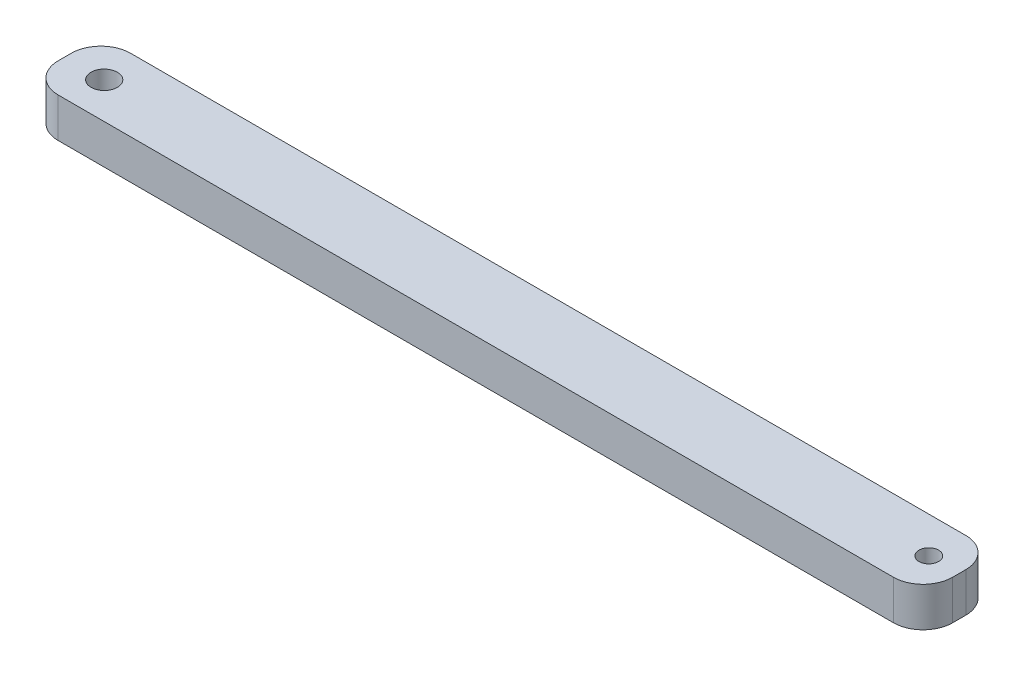
ISO-10303-21;
HEADER;
FILE_DESCRIPTION(('STEP AP214'),'2;1');
FILE_NAME('part.step','',(''),(''),'','','');
FILE_SCHEMA(('AUTOMOTIVE_DESIGN { 1 0 10303 214 1 1 1 1 }'));
ENDSEC;
DATA;
#1=APPLICATION_CONTEXT('core data for automotive mechanical design processes');
#2=APPLICATION_PROTOCOL_DEFINITION('international standard','automotive_design',2000,#1);
#3=PRODUCT_CONTEXT('',#1,'mechanical');
#4=PRODUCT('Part','Part','',(#3));
#5=PRODUCT_RELATED_PRODUCT_CATEGORY('part','',(#4));
#6=PRODUCT_DEFINITION_FORMATION('','',#4);
#7=PRODUCT_DEFINITION_CONTEXT('part definition',#1,'design');
#8=PRODUCT_DEFINITION('design','',#6,#7);
#9=PRODUCT_DEFINITION_SHAPE('','',#8);
#10=(LENGTH_UNIT() NAMED_UNIT(*) SI_UNIT(.MILLI.,.METRE.));
#11=(NAMED_UNIT(*) PLANE_ANGLE_UNIT() SI_UNIT($,.RADIAN.));
#12=(NAMED_UNIT(*) SI_UNIT($,.STERADIAN.) SOLID_ANGLE_UNIT());
#13=UNCERTAINTY_MEASURE_WITH_UNIT(LENGTH_MEASURE(1.E-05),#10,'distance_accuracy_value','');
#14=(GEOMETRIC_REPRESENTATION_CONTEXT(3) GLOBAL_UNCERTAINTY_ASSIGNED_CONTEXT((#13)) GLOBAL_UNIT_ASSIGNED_CONTEXT((#10,
#11,#12)) REPRESENTATION_CONTEXT('',''));
#15=CARTESIAN_POINT('',(0.,0.,0.));
#16=DIRECTION('',(0.,0.,1.));
#17=DIRECTION('',(1.,0.,0.));
#18=AXIS2_PLACEMENT_3D('',#15,#16,#17);
#19=CARTESIAN_POINT('',(0.,3.,0.));
#20=DIRECTION('',(0.,1.,0.));
#21=DIRECTION('',(0.,0.,1.));
#22=AXIS2_PLACEMENT_3D('',#19,#20,#21);
#23=PLANE('',#22);
#24=CARTESIAN_POINT('',(36.0480952380952,3.,-10.9404761904762));
#25=DIRECTION('',(0.,1.,0.));
#26=DIRECTION('',(0.,0.,1.));
#27=AXIS2_PLACEMENT_3D('',#24,#25,#26);
#28=CIRCLE('',#27,0.749999999999999);
#29=CARTESIAN_POINT('',(36.0480952380952,3.,-10.1904761904762));
#30=VERTEX_POINT('',#29);
#31=EDGE_CURVE('E136',#30,#30,#28,.T.);
#32=ORIENTED_EDGE('',*,*,#31,.F.);
#33=EDGE_LOOP('',(#32));
#34=FACE_BOUND('',#33,.T.);
#35=DIRECTION('',(-1.,0.,0.));
#36=VECTOR('',#35,1.);
#37=CARTESIAN_POINT('',(-29.6369047619048,3.,-13.6904761904762));
#38=LINE('',#37,#36);
#39=CARTESIAN_POINT('',(36.1130952380952,3.,-13.6904761904762));
#40=VERTEX_POINT('',#39);
#41=CARTESIAN_POINT('',(-27.3869047619048,3.,-13.6904761904762));
#42=VERTEX_POINT('',#41);
#43=EDGE_CURVE('E147',#40,#42,#38,.T.);
#44=ORIENTED_EDGE('',*,*,#43,.T.);
#45=CARTESIAN_POINT('',(-27.3869047619048,3.,-11.4404761904762));
#46=DIRECTION('',(0.,1.,0.));
#47=DIRECTION('',(0.,0.,1.));
#48=AXIS2_PLACEMENT_3D('',#45,#46,#47);
#49=CIRCLE('',#48,2.25);
#50=CARTESIAN_POINT('',(-29.6369047619048,3.,-11.4404761904762));
#51=VERTEX_POINT('',#50);
#52=EDGE_CURVE('E177',#42,#51,#49,.T.);
#53=ORIENTED_EDGE('',*,*,#52,.T.);
#54=DIRECTION('',(0.,0.,1.));
#55=VECTOR('',#54,1.);
#56=CARTESIAN_POINT('',(-29.6369047619048,3.,-13.6904761904762));
#57=LINE('',#56,#55);
#58=CARTESIAN_POINT('',(-29.6369047619048,3.,-10.4404761904762));
#59=VERTEX_POINT('',#58);
#60=EDGE_CURVE('E126',#51,#59,#57,.T.);
#61=ORIENTED_EDGE('',*,*,#60,.T.);
#62=CARTESIAN_POINT('',(-27.3869047619048,3.,-10.4404761904762));
#63=DIRECTION('',(0.,1.,0.));
#64=DIRECTION('',(0.,0.,1.));
#65=AXIS2_PLACEMENT_3D('',#62,#63,#64);
#66=CIRCLE('',#65,2.25);
#67=CARTESIAN_POINT('',(-27.3869047619048,3.,-8.19047619047619));
#68=VERTEX_POINT('',#67);
#69=EDGE_CURVE('E174',#59,#68,#66,.T.);
#70=ORIENTED_EDGE('',*,*,#69,.T.);
#71=DIRECTION('',(1.,0.,0.));
#72=VECTOR('',#71,1.);
#73=CARTESIAN_POINT('',(-29.6369047619048,3.,-8.19047619047619));
#74=LINE('',#73,#72);
#75=CARTESIAN_POINT('',(36.1130952380952,3.,-8.19047619047619));
#76=VERTEX_POINT('',#75);
#77=EDGE_CURVE('E203',#68,#76,#74,.T.);
#78=ORIENTED_EDGE('',*,*,#77,.T.);
#79=CARTESIAN_POINT('',(36.1130952380952,3.,-10.4404761904762));
#80=DIRECTION('',(0.,1.,0.));
#81=DIRECTION('',(0.,0.,1.));
#82=AXIS2_PLACEMENT_3D('',#79,#80,#81);
#83=CIRCLE('',#82,2.25);
#84=CARTESIAN_POINT('',(38.3630952380952,3.,-10.4404761904762));
#85=VERTEX_POINT('',#84);
#86=EDGE_CURVE('E60',#76,#85,#83,.T.);
#87=ORIENTED_EDGE('',*,*,#86,.T.);
#88=DIRECTION('',(0.,0.,-1.));
#89=VECTOR('',#88,1.);
#90=CARTESIAN_POINT('',(38.3630952380952,3.,-13.6904761904762));
#91=LINE('',#90,#89);
#92=CARTESIAN_POINT('',(38.3630952380952,3.,-11.4404761904762));
#93=VERTEX_POINT('',#92);
#94=EDGE_CURVE('E191',#85,#93,#91,.T.);
#95=ORIENTED_EDGE('',*,*,#94,.T.);
#96=CARTESIAN_POINT('',(36.1130952380952,3.,-11.4404761904762));
#97=DIRECTION('',(0.,1.,0.));
#98=DIRECTION('',(0.,0.,1.));
#99=AXIS2_PLACEMENT_3D('',#96,#97,#98);
#100=CIRCLE('',#99,2.25);
#101=EDGE_CURVE('E171',#93,#40,#100,.T.);
#102=ORIENTED_EDGE('',*,*,#101,.T.);
#103=EDGE_LOOP('',(#44,#53,#61,#70,#78,#87,#95,#102));
#104=FACE_BOUND('',#103,.T.);
#105=CARTESIAN_POINT('',(-26.6369047619048,3.,-10.9404761904762));
#106=DIRECTION('',(0.,1.,0.));
#107=DIRECTION('',(0.,0.,-1.));
#108=AXIS2_PLACEMENT_3D('',#105,#106,#107);
#109=CIRCLE('',#108,1.);
#110=CARTESIAN_POINT('',(-26.6369047619048,3.,-11.9404761904762));
#111=VERTEX_POINT('',#110);
#112=EDGE_CURVE('E211',#111,#111,#109,.T.);
#113=ORIENTED_EDGE('',*,*,#112,.F.);
#114=EDGE_LOOP('',(#113));
#115=FACE_BOUND('',#114,.T.);
#116=ADVANCED_FACE('F39',(#34,#104,#115),#23,.T.);
#117=CARTESIAN_POINT('',(0.,0.,0.));
#118=DIRECTION('',(0.,1.,0.));
#119=DIRECTION('',(0.,0.,1.));
#120=AXIS2_PLACEMENT_3D('',#117,#118,#119);
#121=PLANE('',#120);
#122=DIRECTION('',(0.,0.,1.));
#123=VECTOR('',#122,1.);
#124=CARTESIAN_POINT('',(-29.6369047619048,0.,-13.6904761904762));
#125=LINE('',#124,#123);
#126=CARTESIAN_POINT('',(-29.6369047619048,0.,-11.4404761904762));
#127=VERTEX_POINT('',#126);
#128=CARTESIAN_POINT('',(-29.6369047619048,0.,-10.4404761904762));
#129=VERTEX_POINT('',#128);
#130=EDGE_CURVE('E123',#127,#129,#125,.T.);
#131=ORIENTED_EDGE('',*,*,#130,.F.);
#132=CARTESIAN_POINT('',(-27.3869047619048,0.,-11.4404761904762));
#133=DIRECTION('',(0.,1.,0.));
#134=DIRECTION('',(0.,0.,1.));
#135=AXIS2_PLACEMENT_3D('',#132,#133,#134);
#136=CIRCLE('',#135,2.25);
#137=CARTESIAN_POINT('',(-27.3869047619048,0.,-13.6904761904762));
#138=VERTEX_POINT('',#137);
#139=EDGE_CURVE('E105',#127,#138,#136,.F.);
#140=ORIENTED_EDGE('',*,*,#139,.T.);
#141=DIRECTION('',(-1.,0.,0.));
#142=VECTOR('',#141,1.);
#143=CARTESIAN_POINT('',(-29.6369047619048,0.,-13.6904761904762));
#144=LINE('',#143,#142);
#145=CARTESIAN_POINT('',(36.1130952380952,0.,-13.6904761904762));
#146=VERTEX_POINT('',#145);
#147=EDGE_CURVE('E152',#146,#138,#144,.T.);
#148=ORIENTED_EDGE('',*,*,#147,.F.);
#149=CARTESIAN_POINT('',(36.1130952380952,0.,-11.4404761904762));
#150=DIRECTION('',(0.,1.,0.));
#151=DIRECTION('',(0.,0.,1.));
#152=AXIS2_PLACEMENT_3D('',#149,#150,#151);
#153=CIRCLE('',#152,2.25);
#154=CARTESIAN_POINT('',(38.3630952380952,0.,-11.4404761904762));
#155=VERTEX_POINT('',#154);
#156=EDGE_CURVE('E159',#146,#155,#153,.F.);
#157=ORIENTED_EDGE('',*,*,#156,.T.);
#158=DIRECTION('',(0.,0.,-1.));
#159=VECTOR('',#158,1.);
#160=CARTESIAN_POINT('',(38.3630952380952,0.,-13.6904761904762));
#161=LINE('',#160,#159);
#162=CARTESIAN_POINT('',(38.3630952380952,0.,-10.4404761904762));
#163=VERTEX_POINT('',#162);
#164=EDGE_CURVE('E141',#163,#155,#161,.T.);
#165=ORIENTED_EDGE('',*,*,#164,.F.);
#166=CARTESIAN_POINT('',(36.1130952380952,0.,-10.4404761904762));
#167=DIRECTION('',(0.,1.,0.));
#168=DIRECTION('',(0.,0.,1.));
#169=AXIS2_PLACEMENT_3D('',#166,#167,#168);
#170=CIRCLE('',#169,2.25);
#171=CARTESIAN_POINT('',(36.1130952380952,0.,-8.19047619047619));
#172=VERTEX_POINT('',#171);
#173=EDGE_CURVE('E128',#163,#172,#170,.F.);
#174=ORIENTED_EDGE('',*,*,#173,.T.);
#175=DIRECTION('',(1.,0.,0.));
#176=VECTOR('',#175,1.);
#177=CARTESIAN_POINT('',(-29.6369047619048,0.,-8.19047619047619));
#178=LINE('',#177,#176);
#179=CARTESIAN_POINT('',(-27.3869047619048,0.,-8.19047619047619));
#180=VERTEX_POINT('',#179);
#181=EDGE_CURVE('E135',#180,#172,#178,.T.);
#182=ORIENTED_EDGE('',*,*,#181,.F.);
#183=CARTESIAN_POINT('',(-27.3869047619048,0.,-10.4404761904762));
#184=DIRECTION('',(0.,1.,0.));
#185=DIRECTION('',(0.,0.,1.));
#186=AXIS2_PLACEMENT_3D('',#183,#184,#185);
#187=CIRCLE('',#186,2.25);
#188=EDGE_CURVE('E117',#180,#129,#187,.F.);
#189=ORIENTED_EDGE('',*,*,#188,.T.);
#190=EDGE_LOOP('',(#131,#140,#148,#157,#165,#174,#182,#189));
#191=FACE_BOUND('',#190,.T.);
#192=CARTESIAN_POINT('',(36.0480952380952,0.,-10.9404761904762));
#193=DIRECTION('',(0.,1.,0.));
#194=DIRECTION('',(0.,0.,1.));
#195=AXIS2_PLACEMENT_3D('',#192,#193,#194);
#196=CIRCLE('',#195,0.749999999999999);
#197=CARTESIAN_POINT('',(36.0480952380952,0.,-10.1904761904762));
#198=VERTEX_POINT('',#197);
#199=EDGE_CURVE('E144',#198,#198,#196,.T.);
#200=ORIENTED_EDGE('',*,*,#199,.T.);
#201=EDGE_LOOP('',(#200));
#202=FACE_BOUND('',#201,.T.);
#203=CARTESIAN_POINT('',(-26.6369047619048,0.,-10.9404761904762));
#204=DIRECTION('',(0.,1.,0.));
#205=DIRECTION('',(0.,0.,-1.));
#206=AXIS2_PLACEMENT_3D('',#203,#204,#205);
#207=CIRCLE('',#206,1.);
#208=CARTESIAN_POINT('',(-26.6369047619048,0.,-11.9404761904762));
#209=VERTEX_POINT('',#208);
#210=EDGE_CURVE('E213',#209,#209,#207,.T.);
#211=ORIENTED_EDGE('',*,*,#210,.T.);
#212=EDGE_LOOP('',(#211));
#213=FACE_BOUND('',#212,.T.);
#214=ADVANCED_FACE('F131',(#191,#202,#213),#121,.F.);
#215=CARTESIAN_POINT('',(-29.6369047619048,3.,-13.6904761904762));
#216=DIRECTION('',(1.,0.,0.));
#217=DIRECTION('',(0.,0.,-1.));
#218=AXIS2_PLACEMENT_3D('',#215,#216,#217);
#219=PLANE('',#218);
#220=ORIENTED_EDGE('',*,*,#60,.F.);
#221=DIRECTION('',(0.,-1.,0.));
#222=VECTOR('',#221,1.);
#223=CARTESIAN_POINT('',(-29.6369047619048,3.,-11.4404761904762));
#224=LINE('',#223,#222);
#225=EDGE_CURVE('E109',#51,#127,#224,.T.);
#226=ORIENTED_EDGE('',*,*,#225,.T.);
#227=ORIENTED_EDGE('',*,*,#130,.T.);
#228=DIRECTION('',(0.,-1.,0.));
#229=VECTOR('',#228,1.);
#230=CARTESIAN_POINT('',(-29.6369047619048,3.,-10.4404761904762));
#231=LINE('',#230,#229);
#232=EDGE_CURVE('E129',#129,#59,#231,.F.);
#233=ORIENTED_EDGE('',*,*,#232,.T.);
#234=EDGE_LOOP('',(#220,#226,#227,#233));
#235=FACE_BOUND('',#234,.T.);
#236=ADVANCED_FACE('F122',(#235),#219,.F.);
#237=CARTESIAN_POINT('',(-29.6369047619048,3.,-8.19047619047619));
#238=DIRECTION('',(0.,0.,-1.));
#239=DIRECTION('',(-1.,0.,0.));
#240=AXIS2_PLACEMENT_3D('',#237,#238,#239);
#241=PLANE('',#240);
#242=ORIENTED_EDGE('',*,*,#77,.F.);
#243=DIRECTION('',(0.,-1.,0.));
#244=VECTOR('',#243,1.);
#245=CARTESIAN_POINT('',(-27.3869047619048,3.,-8.19047619047619));
#246=LINE('',#245,#244);
#247=EDGE_CURVE('E183',#68,#180,#246,.T.);
#248=ORIENTED_EDGE('',*,*,#247,.T.);
#249=ORIENTED_EDGE('',*,*,#181,.T.);
#250=DIRECTION('',(0.,-1.,0.));
#251=VECTOR('',#250,1.);
#252=CARTESIAN_POINT('',(36.1130952380952,3.,-8.19047619047619));
#253=LINE('',#252,#251);
#254=EDGE_CURVE('E180',#172,#76,#253,.F.);
#255=ORIENTED_EDGE('',*,*,#254,.T.);
#256=EDGE_LOOP('',(#242,#248,#249,#255));
#257=FACE_BOUND('',#256,.T.);
#258=ADVANCED_FACE('F240',(#257),#241,.F.);
#259=CARTESIAN_POINT('',(38.3630952380952,3.,-13.6904761904762));
#260=DIRECTION('',(-1.,0.,0.));
#261=DIRECTION('',(0.,0.,1.));
#262=AXIS2_PLACEMENT_3D('',#259,#260,#261);
#263=PLANE('',#262);
#264=ORIENTED_EDGE('',*,*,#164,.T.);
#265=DIRECTION('',(0.,-1.,0.));
#266=VECTOR('',#265,1.);
#267=CARTESIAN_POINT('',(38.3630952380952,3.,-11.4404761904762));
#268=LINE('',#267,#266);
#269=EDGE_CURVE('E11',#155,#93,#268,.F.);
#270=ORIENTED_EDGE('',*,*,#269,.T.);
#271=ORIENTED_EDGE('',*,*,#94,.F.);
#272=DIRECTION('',(0.,-1.,0.));
#273=VECTOR('',#272,1.);
#274=CARTESIAN_POINT('',(38.3630952380952,3.,-10.4404761904762));
#275=LINE('',#274,#273);
#276=EDGE_CURVE('E48',#85,#163,#275,.T.);
#277=ORIENTED_EDGE('',*,*,#276,.T.);
#278=EDGE_LOOP('',(#264,#270,#271,#277));
#279=FACE_BOUND('',#278,.T.);
#280=ADVANCED_FACE('F190',(#279),#263,.F.);
#281=CARTESIAN_POINT('',(-29.6369047619048,3.,-13.6904761904762));
#282=DIRECTION('',(0.,0.,1.));
#283=DIRECTION('',(1.,0.,0.));
#284=AXIS2_PLACEMENT_3D('',#281,#282,#283);
#285=PLANE('',#284);
#286=ORIENTED_EDGE('',*,*,#147,.T.);
#287=DIRECTION('',(0.,-1.,0.));
#288=VECTOR('',#287,1.);
#289=CARTESIAN_POINT('',(-27.3869047619048,3.,-13.6904761904762));
#290=LINE('',#289,#288);
#291=EDGE_CURVE('E110',#138,#42,#290,.F.);
#292=ORIENTED_EDGE('',*,*,#291,.T.);
#293=ORIENTED_EDGE('',*,*,#43,.F.);
#294=DIRECTION('',(0.,-1.,0.));
#295=VECTOR('',#294,1.);
#296=CARTESIAN_POINT('',(36.1130952380952,3.,-13.6904761904762));
#297=LINE('',#296,#295);
#298=EDGE_CURVE('E116',#40,#146,#297,.T.);
#299=ORIENTED_EDGE('',*,*,#298,.T.);
#300=EDGE_LOOP('',(#286,#292,#293,#299));
#301=FACE_BOUND('',#300,.T.);
#302=ADVANCED_FACE('F199',(#301),#285,.F.);
#303=CARTESIAN_POINT('',(36.0480952380952,3.,-10.9404761904762));
#304=DIRECTION('',(0.,-1.,0.));
#305=DIRECTION('',(0.,0.,-1.));
#306=AXIS2_PLACEMENT_3D('',#303,#304,#305);
#307=CYLINDRICAL_SURFACE('',#306,0.749999999999999);
#308=ORIENTED_EDGE('',*,*,#31,.T.);
#309=EDGE_LOOP('',(#308));
#310=FACE_BOUND('',#309,.T.);
#311=ORIENTED_EDGE('',*,*,#199,.F.);
#312=EDGE_LOOP('',(#311));
#313=FACE_BOUND('',#312,.T.);
#314=ADVANCED_FACE('F233',(#310,#313),#307,.F.);
#315=CARTESIAN_POINT('',(-26.6369047619048,3.,-10.9404761904762));
#316=DIRECTION('',(0.,-1.,0.));
#317=DIRECTION('',(0.,0.,-1.));
#318=AXIS2_PLACEMENT_3D('',#315,#316,#317);
#319=CYLINDRICAL_SURFACE('',#318,1.);
#320=ORIENTED_EDGE('',*,*,#112,.T.);
#321=EDGE_LOOP('',(#320));
#322=FACE_BOUND('',#321,.T.);
#323=ORIENTED_EDGE('',*,*,#210,.F.);
#324=EDGE_LOOP('',(#323));
#325=FACE_BOUND('',#324,.T.);
#326=ADVANCED_FACE('F221',(#322,#325),#319,.F.);
#327=CARTESIAN_POINT('',(-27.3869047619048,3.,-11.4404761904762));
#328=DIRECTION('',(0.,-1.,0.));
#329=DIRECTION('',(0.,0.,-1.));
#330=AXIS2_PLACEMENT_3D('',#327,#328,#329);
#331=CYLINDRICAL_SURFACE('',#330,2.25);
#332=ORIENTED_EDGE('',*,*,#52,.F.);
#333=ORIENTED_EDGE('',*,*,#291,.F.);
#334=ORIENTED_EDGE('',*,*,#139,.F.);
#335=ORIENTED_EDGE('',*,*,#225,.F.);
#336=EDGE_LOOP('',(#332,#333,#334,#335));
#337=FACE_BOUND('',#336,.T.);
#338=ADVANCED_FACE('F108',(#337),#331,.T.);
#339=CARTESIAN_POINT('',(-27.3869047619048,3.,-10.4404761904762));
#340=DIRECTION('',(0.,-1.,0.));
#341=DIRECTION('',(0.,0.,-1.));
#342=AXIS2_PLACEMENT_3D('',#339,#340,#341);
#343=CYLINDRICAL_SURFACE('',#342,2.25);
#344=ORIENTED_EDGE('',*,*,#69,.F.);
#345=ORIENTED_EDGE('',*,*,#232,.F.);
#346=ORIENTED_EDGE('',*,*,#188,.F.);
#347=ORIENTED_EDGE('',*,*,#247,.F.);
#348=EDGE_LOOP('',(#344,#345,#346,#347));
#349=FACE_BOUND('',#348,.T.);
#350=ADVANCED_FACE('F248',(#349),#343,.T.);
#351=CARTESIAN_POINT('',(36.1130952380952,3.,-11.4404761904762));
#352=DIRECTION('',(0.,-1.,0.));
#353=DIRECTION('',(0.,0.,-1.));
#354=AXIS2_PLACEMENT_3D('',#351,#352,#353);
#355=CYLINDRICAL_SURFACE('',#354,2.25);
#356=ORIENTED_EDGE('',*,*,#101,.F.);
#357=ORIENTED_EDGE('',*,*,#269,.F.);
#358=ORIENTED_EDGE('',*,*,#156,.F.);
#359=ORIENTED_EDGE('',*,*,#298,.F.);
#360=EDGE_LOOP('',(#356,#357,#358,#359));
#361=FACE_BOUND('',#360,.T.);
#362=ADVANCED_FACE('F196',(#361),#355,.T.);
#363=CARTESIAN_POINT('',(36.1130952380952,3.,-10.4404761904762));
#364=DIRECTION('',(0.,-1.,0.));
#365=DIRECTION('',(0.,0.,-1.));
#366=AXIS2_PLACEMENT_3D('',#363,#364,#365);
#367=CYLINDRICAL_SURFACE('',#366,2.25);
#368=ORIENTED_EDGE('',*,*,#86,.F.);
#369=ORIENTED_EDGE('',*,*,#254,.F.);
#370=ORIENTED_EDGE('',*,*,#173,.F.);
#371=ORIENTED_EDGE('',*,*,#276,.F.);
#372=EDGE_LOOP('',(#368,#369,#370,#371));
#373=FACE_BOUND('',#372,.T.);
#374=ADVANCED_FACE('F41',(#373),#367,.T.);
#375=CLOSED_SHELL('',(#116,#214,#236,#258,#280,#302,#314,#326,#338,#350,#362,#374));
#376=MANIFOLD_SOLID_BREP('B2',#375);
#377=ADVANCED_BREP_SHAPE_REPRESENTATION('',(#18,#376),#14);
#378=SHAPE_DEFINITION_REPRESENTATION(#9,#377);
ENDSEC;
END-ISO-10303-21;
